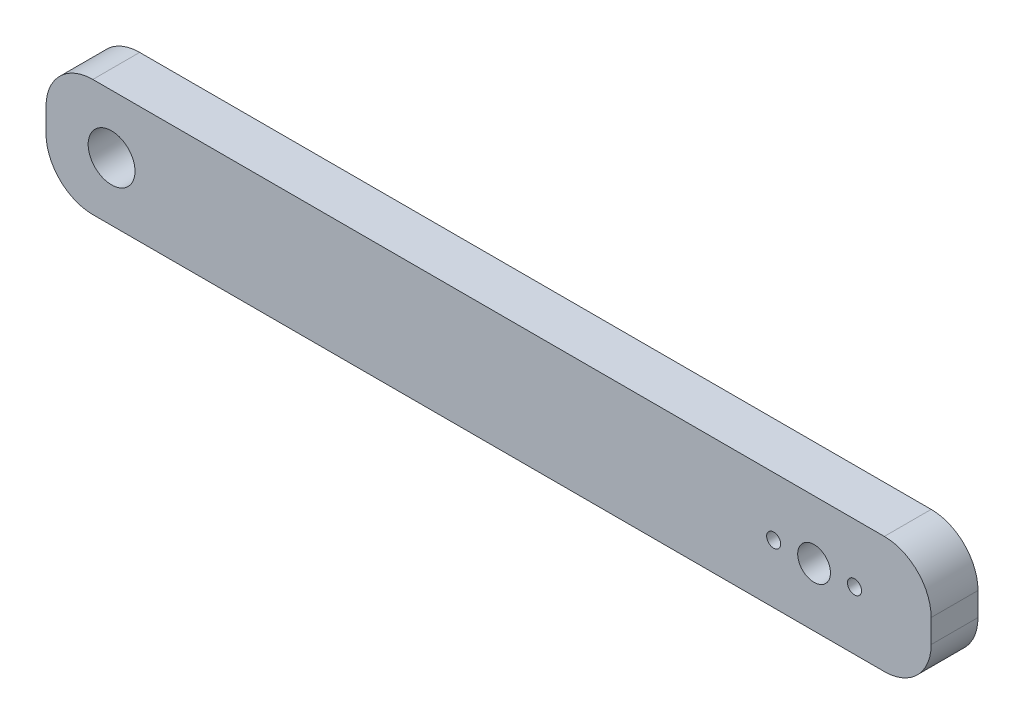
ISO-10303-21;
HEADER;
FILE_DESCRIPTION(('STEP AP214'),'2;1');
FILE_NAME('part.step','',(''),(''),'','','');
FILE_SCHEMA(('AUTOMOTIVE_DESIGN { 1 0 10303 214 1 1 1 1 }'));
ENDSEC;
DATA;
#1=APPLICATION_CONTEXT('core data for automotive mechanical design processes');
#2=APPLICATION_PROTOCOL_DEFINITION('international standard','automotive_design',2000,#1);
#3=PRODUCT_CONTEXT('',#1,'mechanical');
#4=PRODUCT('Part','Part','',(#3));
#5=PRODUCT_RELATED_PRODUCT_CATEGORY('part','',(#4));
#6=PRODUCT_DEFINITION_FORMATION('','',#4);
#7=PRODUCT_DEFINITION_CONTEXT('part definition',#1,'design');
#8=PRODUCT_DEFINITION('design','',#6,#7);
#9=PRODUCT_DEFINITION_SHAPE('','',#8);
#10=(LENGTH_UNIT() NAMED_UNIT(*) SI_UNIT(.MILLI.,.METRE.));
#11=(NAMED_UNIT(*) PLANE_ANGLE_UNIT() SI_UNIT($,.RADIAN.));
#12=(NAMED_UNIT(*) SI_UNIT($,.STERADIAN.) SOLID_ANGLE_UNIT());
#13=UNCERTAINTY_MEASURE_WITH_UNIT(LENGTH_MEASURE(1.E-05),#10,'distance_accuracy_value','');
#14=(GEOMETRIC_REPRESENTATION_CONTEXT(3) GLOBAL_UNCERTAINTY_ASSIGNED_CONTEXT((#13)) GLOBAL_UNIT_ASSIGNED_CONTEXT((#10,
#11,#12)) REPRESENTATION_CONTEXT('',''));
#15=CARTESIAN_POINT('',(0.,0.,0.));
#16=DIRECTION('',(0.,0.,1.));
#17=DIRECTION('',(1.,0.,0.));
#18=AXIS2_PLACEMENT_3D('',#15,#16,#17);
#19=CARTESIAN_POINT('',(-90.8474576271186,-10.,10.));
#20=DIRECTION('',(0.,0.,-1.));
#21=DIRECTION('',(-1.,0.,0.));
#22=AXIS2_PLACEMENT_3D('',#19,#20,#21);
#23=PLANE('',#22);
#24=DIRECTION('',(-1.,0.,0.));
#25=VECTOR('',#24,1.);
#26=CARTESIAN_POINT('',(78.1525423728813,0.,10.));
#27=LINE('',#26,#25);
#28=CARTESIAN_POINT('',(78.1525423728813,0.,10.));
#29=VERTEX_POINT('',#28);
#30=CARTESIAN_POINT('',(-90.8474576271186,0.,10.));
#31=VERTEX_POINT('',#30);
#32=EDGE_CURVE('E99',#29,#31,#27,.T.);
#33=ORIENTED_EDGE('',*,*,#32,.T.);
#34=CARTESIAN_POINT('',(-90.8474576271186,-10.,10.));
#35=DIRECTION('',(0.,0.,1.));
#36=DIRECTION('',(-1.,0.,0.));
#37=AXIS2_PLACEMENT_3D('',#34,#35,#36);
#38=CIRCLE('',#37,10.);
#39=CARTESIAN_POINT('',(-100.847457627119,-10.0000000000001,10.));
#40=VERTEX_POINT('',#39);
#41=EDGE_CURVE('E205',#31,#40,#38,.T.);
#42=ORIENTED_EDGE('',*,*,#41,.T.);
#43=DIRECTION('',(0.,-1.,0.));
#44=VECTOR('',#43,1.);
#45=CARTESIAN_POINT('',(-100.847457627119,-10.0000000000001,10.));
#46=LINE('',#45,#44);
#47=CARTESIAN_POINT('',(-100.847457627119,-14.9999999999999,10.));
#48=VERTEX_POINT('',#47);
#49=EDGE_CURVE('E185',#40,#48,#46,.T.);
#50=ORIENTED_EDGE('',*,*,#49,.T.);
#51=CARTESIAN_POINT('',(-90.8474576271186,-15.,10.));
#52=DIRECTION('',(0.,0.,1.));
#53=DIRECTION('',(1.,0.,0.));
#54=AXIS2_PLACEMENT_3D('',#51,#52,#53);
#55=CIRCLE('',#54,10.);
#56=CARTESIAN_POINT('',(-90.8474576271186,-25.,10.));
#57=VERTEX_POINT('',#56);
#58=EDGE_CURVE('E199',#48,#57,#55,.T.);
#59=ORIENTED_EDGE('',*,*,#58,.T.);
#60=DIRECTION('',(1.,0.,0.));
#61=VECTOR('',#60,1.);
#62=CARTESIAN_POINT('',(-90.8474576271186,-25.,10.));
#63=LINE('',#62,#61);
#64=CARTESIAN_POINT('',(78.1525423728814,-25.,10.));
#65=VERTEX_POINT('',#64);
#66=EDGE_CURVE('E119',#57,#65,#63,.T.);
#67=ORIENTED_EDGE('',*,*,#66,.T.);
#68=CARTESIAN_POINT('',(78.1525423728814,-15.,10.));
#69=DIRECTION('',(0.,0.,1.));
#70=DIRECTION('',(-1.,0.,0.));
#71=AXIS2_PLACEMENT_3D('',#68,#69,#70);
#72=CIRCLE('',#71,9.99999999999998);
#73=CARTESIAN_POINT('',(88.1525423728813,-15.,10.));
#74=VERTEX_POINT('',#73);
#75=EDGE_CURVE('E113',#65,#74,#72,.T.);
#76=ORIENTED_EDGE('',*,*,#75,.T.);
#77=DIRECTION('',(0.,1.,0.));
#78=VECTOR('',#77,1.);
#79=CARTESIAN_POINT('',(88.1525423728813,-15.,10.));
#80=LINE('',#79,#78);
#81=CARTESIAN_POINT('',(88.1525423728813,-9.99999999999999,10.));
#82=VERTEX_POINT('',#81);
#83=EDGE_CURVE('E117',#74,#82,#80,.T.);
#84=ORIENTED_EDGE('',*,*,#83,.T.);
#85=CARTESIAN_POINT('',(78.1525423728813,-9.99999999999999,10.));
#86=DIRECTION('',(0.,0.,1.));
#87=DIRECTION('',(1.,0.,0.));
#88=AXIS2_PLACEMENT_3D('',#85,#86,#87);
#89=CIRCLE('',#88,9.99999999999999);
#90=EDGE_CURVE('E57',#82,#29,#89,.T.);
#91=ORIENTED_EDGE('',*,*,#90,.T.);
#92=EDGE_LOOP('',(#33,#42,#50,#59,#67,#76,#84,#91));
#93=FACE_BOUND('',#92,.T.);
#94=CARTESIAN_POINT('',(-86.8474576271187,-12.5,10.));
#95=DIRECTION('',(0.,0.,1.));
#96=DIRECTION('',(1.,0.,0.));
#97=AXIS2_PLACEMENT_3D('',#94,#95,#96);
#98=CIRCLE('',#97,5.);
#99=CARTESIAN_POINT('',(-81.8474576271186,-12.5,10.));
#100=VERTEX_POINT('',#99);
#101=EDGE_CURVE('E144',#100,#100,#98,.T.);
#102=ORIENTED_EDGE('',*,*,#101,.F.);
#103=EDGE_LOOP('',(#102));
#104=FACE_BOUND('',#103,.T.);
#105=CARTESIAN_POINT('',(63.1525423728813,-12.5,10.));
#106=DIRECTION('',(0.,0.,1.));
#107=DIRECTION('',(1.,0.,0.));
#108=AXIS2_PLACEMENT_3D('',#105,#106,#107);
#109=CIRCLE('',#108,3.50000000000001);
#110=CARTESIAN_POINT('',(66.6525423728813,-12.5,10.));
#111=VERTEX_POINT('',#110);
#112=EDGE_CURVE('E214',#111,#111,#109,.T.);
#113=ORIENTED_EDGE('',*,*,#112,.F.);
#114=EDGE_LOOP('',(#113));
#115=FACE_BOUND('',#114,.T.);
#116=CARTESIAN_POINT('',(54.5225423728813,-12.5,10.));
#117=DIRECTION('',(0.,0.,1.));
#118=DIRECTION('',(1.,0.,0.));
#119=AXIS2_PLACEMENT_3D('',#116,#117,#118);
#120=CIRCLE('',#119,1.5);
#121=CARTESIAN_POINT('',(56.0225423728813,-12.5,10.));
#122=VERTEX_POINT('',#121);
#123=EDGE_CURVE('E222',#122,#122,#120,.T.);
#124=ORIENTED_EDGE('',*,*,#123,.F.);
#125=EDGE_LOOP('',(#124));
#126=FACE_BOUND('',#125,.T.);
#127=CARTESIAN_POINT('',(71.7825423728813,-12.5,10.));
#128=DIRECTION('',(0.,0.,1.));
#129=DIRECTION('',(1.,0.,0.));
#130=AXIS2_PLACEMENT_3D('',#127,#128,#129);
#131=CIRCLE('',#130,1.5);
#132=CARTESIAN_POINT('',(73.2825423728813,-12.5,10.));
#133=VERTEX_POINT('',#132);
#134=EDGE_CURVE('E230',#133,#133,#131,.T.);
#135=ORIENTED_EDGE('',*,*,#134,.F.);
#136=EDGE_LOOP('',(#135));
#137=FACE_BOUND('',#136,.T.);
#138=ADVANCED_FACE('F39',(#93,#104,#115,#126,#137),#23,.F.);
#139=CARTESIAN_POINT('',(-90.8474576271186,-10.,0.));
#140=DIRECTION('',(0.,0.,-1.));
#141=DIRECTION('',(-1.,0.,0.));
#142=AXIS2_PLACEMENT_3D('',#139,#140,#141);
#143=PLANE('',#142);
#144=CARTESIAN_POINT('',(54.5225423728813,-12.5,0.));
#145=DIRECTION('',(0.,0.,1.));
#146=DIRECTION('',(1.,0.,0.));
#147=AXIS2_PLACEMENT_3D('',#144,#145,#146);
#148=CIRCLE('',#147,1.5);
#149=CARTESIAN_POINT('',(56.0225423728813,-12.5,0.));
#150=VERTEX_POINT('',#149);
#151=EDGE_CURVE('E226',#150,#150,#148,.T.);
#152=ORIENTED_EDGE('',*,*,#151,.T.);
#153=EDGE_LOOP('',(#152));
#154=FACE_BOUND('',#153,.T.);
#155=CARTESIAN_POINT('',(-86.8474576271187,-12.5,0.));
#156=DIRECTION('',(0.,0.,1.));
#157=DIRECTION('',(1.,0.,0.));
#158=AXIS2_PLACEMENT_3D('',#155,#156,#157);
#159=CIRCLE('',#158,5.);
#160=CARTESIAN_POINT('',(-81.8474576271186,-12.5,0.));
#161=VERTEX_POINT('',#160);
#162=EDGE_CURVE('E210',#161,#161,#159,.T.);
#163=ORIENTED_EDGE('',*,*,#162,.T.);
#164=EDGE_LOOP('',(#163));
#165=FACE_BOUND('',#164,.T.);
#166=DIRECTION('',(-1.,0.,0.));
#167=VECTOR('',#166,1.);
#168=CARTESIAN_POINT('',(0.,0.,0.));
#169=LINE('',#168,#167);
#170=CARTESIAN_POINT('',(78.1525423728813,0.,0.));
#171=VERTEX_POINT('',#170);
#172=CARTESIAN_POINT('',(-90.8474576271186,0.,0.));
#173=VERTEX_POINT('',#172);
#174=EDGE_CURVE('E93',#171,#173,#169,.T.);
#175=ORIENTED_EDGE('',*,*,#174,.F.);
#176=CARTESIAN_POINT('',(78.1525423728813,-9.99999999999999,0.));
#177=DIRECTION('',(0.,0.,1.));
#178=DIRECTION('',(1.,0.,0.));
#179=AXIS2_PLACEMENT_3D('',#176,#177,#178);
#180=CIRCLE('',#179,9.99999999999999);
#181=CARTESIAN_POINT('',(88.1525423728813,-9.99999999999999,0.));
#182=VERTEX_POINT('',#181);
#183=EDGE_CURVE('E160',#182,#171,#180,.T.);
#184=ORIENTED_EDGE('',*,*,#183,.F.);
#185=DIRECTION('',(0.,1.,0.));
#186=VECTOR('',#185,1.);
#187=CARTESIAN_POINT('',(88.1525423728813,-15.,0.));
#188=LINE('',#187,#186);
#189=CARTESIAN_POINT('',(88.1525423728813,-15.,0.));
#190=VERTEX_POINT('',#189);
#191=EDGE_CURVE('E86',#190,#182,#188,.T.);
#192=ORIENTED_EDGE('',*,*,#191,.F.);
#193=CARTESIAN_POINT('',(78.1525423728814,-15.,0.));
#194=DIRECTION('',(0.,0.,1.));
#195=DIRECTION('',(-1.,0.,0.));
#196=AXIS2_PLACEMENT_3D('',#193,#194,#195);
#197=CIRCLE('',#196,9.99999999999998);
#198=CARTESIAN_POINT('',(78.1525423728814,-25.,0.));
#199=VERTEX_POINT('',#198);
#200=EDGE_CURVE('E128',#199,#190,#197,.T.);
#201=ORIENTED_EDGE('',*,*,#200,.F.);
#202=DIRECTION('',(1.,0.,0.));
#203=VECTOR('',#202,1.);
#204=CARTESIAN_POINT('',(-90.8474576271186,-25.,0.));
#205=LINE('',#204,#203);
#206=CARTESIAN_POINT('',(-90.8474576271186,-25.,0.));
#207=VERTEX_POINT('',#206);
#208=EDGE_CURVE('E153',#207,#199,#205,.T.);
#209=ORIENTED_EDGE('',*,*,#208,.F.);
#210=CARTESIAN_POINT('',(-90.8474576271186,-15.,0.));
#211=DIRECTION('',(0.,0.,1.));
#212=DIRECTION('',(1.,0.,0.));
#213=AXIS2_PLACEMENT_3D('',#210,#211,#212);
#214=CIRCLE('',#213,10.);
#215=CARTESIAN_POINT('',(-100.847457627119,-14.9999999999999,0.));
#216=VERTEX_POINT('',#215);
#217=EDGE_CURVE('E150',#216,#207,#214,.T.);
#218=ORIENTED_EDGE('',*,*,#217,.F.);
#219=DIRECTION('',(0.,-1.,0.));
#220=VECTOR('',#219,1.);
#221=CARTESIAN_POINT('',(-100.847457627119,-10.0000000000001,0.));
#222=LINE('',#221,#220);
#223=CARTESIAN_POINT('',(-100.847457627119,-10.0000000000001,0.));
#224=VERTEX_POINT('',#223);
#225=EDGE_CURVE('E147',#224,#216,#222,.T.);
#226=ORIENTED_EDGE('',*,*,#225,.F.);
#227=CARTESIAN_POINT('',(-90.8474576271186,-10.,0.));
#228=DIRECTION('',(0.,0.,1.));
#229=DIRECTION('',(-1.,0.,0.));
#230=AXIS2_PLACEMENT_3D('',#227,#228,#229);
#231=CIRCLE('',#230,10.);
#232=EDGE_CURVE('E143',#173,#224,#231,.T.);
#233=ORIENTED_EDGE('',*,*,#232,.F.);
#234=EDGE_LOOP('',(#175,#184,#192,#201,#209,#218,#226,#233));
#235=FACE_BOUND('',#234,.T.);
#236=CARTESIAN_POINT('',(63.1525423728813,-12.5,0.));
#237=DIRECTION('',(0.,0.,1.));
#238=DIRECTION('',(1.,0.,0.));
#239=AXIS2_PLACEMENT_3D('',#236,#237,#238);
#240=CIRCLE('',#239,3.50000000000001);
#241=CARTESIAN_POINT('',(66.6525423728813,-12.5,0.));
#242=VERTEX_POINT('',#241);
#243=EDGE_CURVE('E218',#242,#242,#240,.T.);
#244=ORIENTED_EDGE('',*,*,#243,.T.);
#245=EDGE_LOOP('',(#244));
#246=FACE_BOUND('',#245,.T.);
#247=CARTESIAN_POINT('',(71.7825423728813,-12.5,0.));
#248=DIRECTION('',(0.,0.,1.));
#249=DIRECTION('',(1.,0.,0.));
#250=AXIS2_PLACEMENT_3D('',#247,#248,#249);
#251=CIRCLE('',#250,1.5);
#252=CARTESIAN_POINT('',(73.2825423728813,-12.5,0.));
#253=VERTEX_POINT('',#252);
#254=EDGE_CURVE('E234',#253,#253,#251,.T.);
#255=ORIENTED_EDGE('',*,*,#254,.T.);
#256=EDGE_LOOP('',(#255));
#257=FACE_BOUND('',#256,.T.);
#258=ADVANCED_FACE('F189',(#154,#165,#235,#246,#257),#143,.T.);
#259=CARTESIAN_POINT('',(0.,0.,10.));
#260=DIRECTION('',(0.,-1.,0.));
#261=DIRECTION('',(0.,0.,-1.));
#262=AXIS2_PLACEMENT_3D('',#259,#260,#261);
#263=PLANE('',#262);
#264=ORIENTED_EDGE('',*,*,#174,.T.);
#265=DIRECTION('',(0.,0.,-1.));
#266=VECTOR('',#265,1.);
#267=CARTESIAN_POINT('',(-90.8474576271186,0.,10.));
#268=LINE('',#267,#266);
#269=EDGE_CURVE('E11',#31,#173,#268,.T.);
#270=ORIENTED_EDGE('',*,*,#269,.F.);
#271=ORIENTED_EDGE('',*,*,#32,.F.);
#272=DIRECTION('',(0.,0.,-1.));
#273=VECTOR('',#272,1.);
#274=CARTESIAN_POINT('',(78.1525423728813,0.,10.));
#275=LINE('',#274,#273);
#276=EDGE_CURVE('E137',#29,#171,#275,.T.);
#277=ORIENTED_EDGE('',*,*,#276,.T.);
#278=EDGE_LOOP('',(#264,#270,#271,#277));
#279=FACE_BOUND('',#278,.T.);
#280=ADVANCED_FACE('F41',(#279),#263,.F.);
#281=CARTESIAN_POINT('',(-90.8474576271186,-10.,10.));
#282=DIRECTION('',(0.,0.,-1.));
#283=DIRECTION('',(-1.,0.,0.));
#284=AXIS2_PLACEMENT_3D('',#281,#282,#283);
#285=CYLINDRICAL_SURFACE('',#284,10.);
#286=ORIENTED_EDGE('',*,*,#232,.T.);
#287=DIRECTION('',(0.,0.,-1.));
#288=VECTOR('',#287,1.);
#289=CARTESIAN_POINT('',(-100.847457627119,-10.0000000000001,10.));
#290=LINE('',#289,#288);
#291=EDGE_CURVE('E49',#40,#224,#290,.T.);
#292=ORIENTED_EDGE('',*,*,#291,.F.);
#293=ORIENTED_EDGE('',*,*,#41,.F.);
#294=ORIENTED_EDGE('',*,*,#269,.T.);
#295=EDGE_LOOP('',(#286,#292,#293,#294));
#296=FACE_BOUND('',#295,.T.);
#297=ADVANCED_FACE('F269',(#296),#285,.T.);
#298=CARTESIAN_POINT('',(-100.847457627119,-10.0000000000001,10.));
#299=DIRECTION('',(1.,0.,0.));
#300=DIRECTION('',(0.,0.,-1.));
#301=AXIS2_PLACEMENT_3D('',#298,#299,#300);
#302=PLANE('',#301);
#303=ORIENTED_EDGE('',*,*,#225,.T.);
#304=DIRECTION('',(0.,0.,-1.));
#305=VECTOR('',#304,1.);
#306=CARTESIAN_POINT('',(-100.847457627119,-14.9999999999999,10.));
#307=LINE('',#306,#305);
#308=EDGE_CURVE('E174',#48,#216,#307,.T.);
#309=ORIENTED_EDGE('',*,*,#308,.F.);
#310=ORIENTED_EDGE('',*,*,#49,.F.);
#311=ORIENTED_EDGE('',*,*,#291,.T.);
#312=EDGE_LOOP('',(#303,#309,#310,#311));
#313=FACE_BOUND('',#312,.T.);
#314=ADVANCED_FACE('F183',(#313),#302,.F.);
#315=CARTESIAN_POINT('',(-90.8474576271186,-15.,10.));
#316=DIRECTION('',(0.,0.,-1.));
#317=DIRECTION('',(-1.,0.,0.));
#318=AXIS2_PLACEMENT_3D('',#315,#316,#317);
#319=CYLINDRICAL_SURFACE('',#318,10.);
#320=ORIENTED_EDGE('',*,*,#217,.T.);
#321=DIRECTION('',(0.,0.,-1.));
#322=VECTOR('',#321,1.);
#323=CARTESIAN_POINT('',(-90.8474576271186,-25.,10.));
#324=LINE('',#323,#322);
#325=EDGE_CURVE('E170',#57,#207,#324,.T.);
#326=ORIENTED_EDGE('',*,*,#325,.F.);
#327=ORIENTED_EDGE('',*,*,#58,.F.);
#328=ORIENTED_EDGE('',*,*,#308,.T.);
#329=EDGE_LOOP('',(#320,#326,#327,#328));
#330=FACE_BOUND('',#329,.T.);
#331=ADVANCED_FACE('F194',(#330),#319,.T.);
#332=CARTESIAN_POINT('',(-90.8474576271186,-25.,10.));
#333=DIRECTION('',(0.,1.,0.));
#334=DIRECTION('',(-1.,0.,0.));
#335=AXIS2_PLACEMENT_3D('',#332,#333,#334);
#336=PLANE('',#335);
#337=ORIENTED_EDGE('',*,*,#208,.T.);
#338=DIRECTION('',(0.,0.,-1.));
#339=VECTOR('',#338,1.);
#340=CARTESIAN_POINT('',(78.1525423728814,-25.,10.));
#341=LINE('',#340,#339);
#342=EDGE_CURVE('E130',#65,#199,#341,.T.);
#343=ORIENTED_EDGE('',*,*,#342,.F.);
#344=ORIENTED_EDGE('',*,*,#66,.F.);
#345=ORIENTED_EDGE('',*,*,#325,.T.);
#346=EDGE_LOOP('',(#337,#343,#344,#345));
#347=FACE_BOUND('',#346,.T.);
#348=ADVANCED_FACE('F197',(#347),#336,.F.);
#349=CARTESIAN_POINT('',(78.1525423728814,-15.,10.));
#350=DIRECTION('',(0.,0.,-1.));
#351=DIRECTION('',(-1.,0.,0.));
#352=AXIS2_PLACEMENT_3D('',#349,#350,#351);
#353=CYLINDRICAL_SURFACE('',#352,9.99999999999998);
#354=ORIENTED_EDGE('',*,*,#200,.T.);
#355=DIRECTION('',(0.,0.,-1.));
#356=VECTOR('',#355,1.);
#357=CARTESIAN_POINT('',(88.1525423728813,-15.,10.));
#358=LINE('',#357,#356);
#359=EDGE_CURVE('E125',#74,#190,#358,.T.);
#360=ORIENTED_EDGE('',*,*,#359,.F.);
#361=ORIENTED_EDGE('',*,*,#75,.F.);
#362=ORIENTED_EDGE('',*,*,#342,.T.);
#363=EDGE_LOOP('',(#354,#360,#361,#362));
#364=FACE_BOUND('',#363,.T.);
#365=ADVANCED_FACE('F126',(#364),#353,.T.);
#366=CARTESIAN_POINT('',(88.1525423728813,-15.,10.));
#367=DIRECTION('',(-1.,0.,0.));
#368=DIRECTION('',(0.,0.,1.));
#369=AXIS2_PLACEMENT_3D('',#366,#367,#368);
#370=PLANE('',#369);
#371=ORIENTED_EDGE('',*,*,#191,.T.);
#372=DIRECTION('',(0.,0.,-1.));
#373=VECTOR('',#372,1.);
#374=CARTESIAN_POINT('',(88.1525423728813,-9.99999999999999,10.));
#375=LINE('',#374,#373);
#376=EDGE_CURVE('E131',#82,#182,#375,.T.);
#377=ORIENTED_EDGE('',*,*,#376,.F.);
#378=ORIENTED_EDGE('',*,*,#83,.F.);
#379=ORIENTED_EDGE('',*,*,#359,.T.);
#380=EDGE_LOOP('',(#371,#377,#378,#379));
#381=FACE_BOUND('',#380,.T.);
#382=ADVANCED_FACE('F133',(#381),#370,.F.);
#383=CARTESIAN_POINT('',(78.1525423728813,-9.99999999999999,10.));
#384=DIRECTION('',(0.,0.,-1.));
#385=DIRECTION('',(-1.,0.,0.));
#386=AXIS2_PLACEMENT_3D('',#383,#384,#385);
#387=CYLINDRICAL_SURFACE('',#386,9.99999999999999);
#388=ORIENTED_EDGE('',*,*,#183,.T.);
#389=ORIENTED_EDGE('',*,*,#276,.F.);
#390=ORIENTED_EDGE('',*,*,#90,.F.);
#391=ORIENTED_EDGE('',*,*,#376,.T.);
#392=EDGE_LOOP('',(#388,#389,#390,#391));
#393=FACE_BOUND('',#392,.T.);
#394=ADVANCED_FACE('F256',(#393),#387,.T.);
#395=CARTESIAN_POINT('',(-86.8474576271187,-12.5,10.));
#396=DIRECTION('',(0.,0.,-1.));
#397=DIRECTION('',(-1.,0.,0.));
#398=AXIS2_PLACEMENT_3D('',#395,#396,#397);
#399=CYLINDRICAL_SURFACE('',#398,5.);
#400=ORIENTED_EDGE('',*,*,#101,.T.);
#401=EDGE_LOOP('',(#400));
#402=FACE_BOUND('',#401,.T.);
#403=ORIENTED_EDGE('',*,*,#162,.F.);
#404=EDGE_LOOP('',(#403));
#405=FACE_BOUND('',#404,.T.);
#406=ADVANCED_FACE('F253',(#402,#405),#399,.F.);
#407=CARTESIAN_POINT('',(63.1525423728813,-12.5,10.));
#408=DIRECTION('',(0.,0.,-1.));
#409=DIRECTION('',(-1.,0.,0.));
#410=AXIS2_PLACEMENT_3D('',#407,#408,#409);
#411=CYLINDRICAL_SURFACE('',#410,3.50000000000001);
#412=ORIENTED_EDGE('',*,*,#112,.T.);
#413=EDGE_LOOP('',(#412));
#414=FACE_BOUND('',#413,.T.);
#415=ORIENTED_EDGE('',*,*,#243,.F.);
#416=EDGE_LOOP('',(#415));
#417=FACE_BOUND('',#416,.T.);
#418=ADVANCED_FACE('F334',(#414,#417),#411,.F.);
#419=CARTESIAN_POINT('',(54.5225423728813,-12.5,10.));
#420=DIRECTION('',(0.,0.,-1.));
#421=DIRECTION('',(-1.,0.,0.));
#422=AXIS2_PLACEMENT_3D('',#419,#420,#421);
#423=CYLINDRICAL_SURFACE('',#422,1.5);
#424=ORIENTED_EDGE('',*,*,#123,.T.);
#425=EDGE_LOOP('',(#424));
#426=FACE_BOUND('',#425,.T.);
#427=ORIENTED_EDGE('',*,*,#151,.F.);
#428=EDGE_LOOP('',(#427));
#429=FACE_BOUND('',#428,.T.);
#430=ADVANCED_FACE('F342',(#426,#429),#423,.F.);
#431=CARTESIAN_POINT('',(71.7825423728813,-12.5,10.));
#432=DIRECTION('',(0.,0.,-1.));
#433=DIRECTION('',(-1.,0.,0.));
#434=AXIS2_PLACEMENT_3D('',#431,#432,#433);
#435=CYLINDRICAL_SURFACE('',#434,1.5);
#436=ORIENTED_EDGE('',*,*,#134,.T.);
#437=EDGE_LOOP('',(#436));
#438=FACE_BOUND('',#437,.T.);
#439=ORIENTED_EDGE('',*,*,#254,.F.);
#440=EDGE_LOOP('',(#439));
#441=FACE_BOUND('',#440,.T.);
#442=ADVANCED_FACE('F242',(#438,#441),#435,.F.);
#443=CLOSED_SHELL('',(#138,#258,#280,#297,#314,#331,#348,#365,#382,#394,#406,#418,#430,#442));
#444=MANIFOLD_SOLID_BREP('B2',#443);
#445=ADVANCED_BREP_SHAPE_REPRESENTATION('',(#18,#444),#14);
#446=SHAPE_DEFINITION_REPRESENTATION(#9,#445);
ENDSEC;
END-ISO-10303-21;
